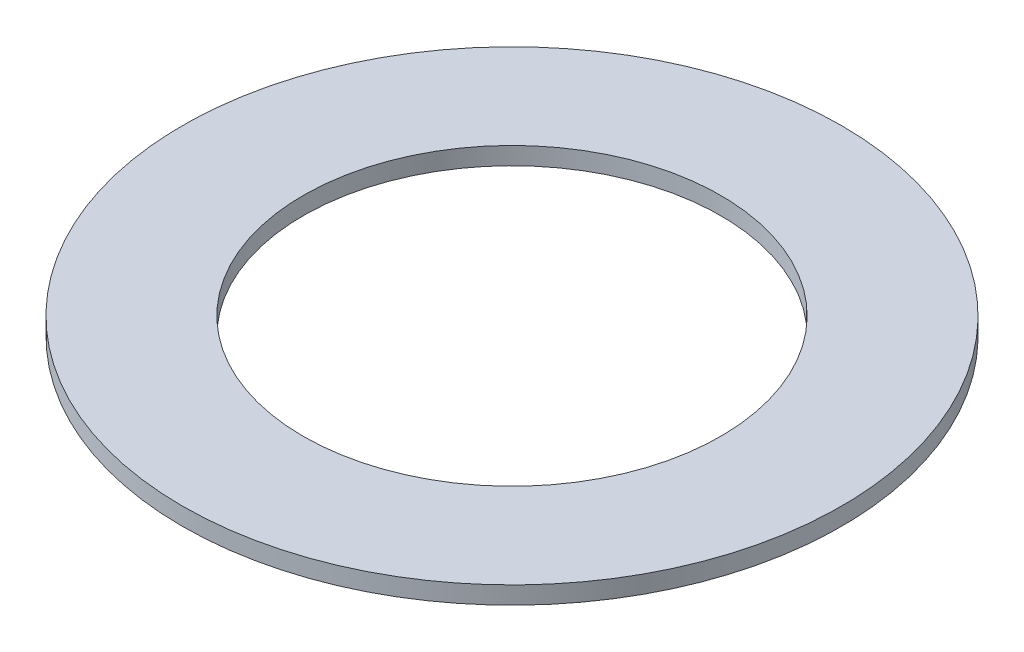
ISO-10303-21;
HEADER;
FILE_DESCRIPTION(('STEP AP214'),'2;1');
FILE_NAME('part.step','',(''),(''),'','','');
FILE_SCHEMA(('AUTOMOTIVE_DESIGN { 1 0 10303 214 1 1 1 1 }'));
ENDSEC;
DATA;
#1=APPLICATION_CONTEXT('core data for automotive mechanical design processes');
#2=APPLICATION_PROTOCOL_DEFINITION('international standard','automotive_design',2000,#1);
#3=PRODUCT_CONTEXT('',#1,'mechanical');
#4=PRODUCT('Part','Part','',(#3));
#5=PRODUCT_RELATED_PRODUCT_CATEGORY('part','',(#4));
#6=PRODUCT_DEFINITION_FORMATION('','',#4);
#7=PRODUCT_DEFINITION_CONTEXT('part definition',#1,'design');
#8=PRODUCT_DEFINITION('design','',#6,#7);
#9=PRODUCT_DEFINITION_SHAPE('','',#8);
#10=(LENGTH_UNIT() NAMED_UNIT(*) SI_UNIT(.MILLI.,.METRE.));
#11=(NAMED_UNIT(*) PLANE_ANGLE_UNIT() SI_UNIT($,.RADIAN.));
#12=(NAMED_UNIT(*) SI_UNIT($,.STERADIAN.) SOLID_ANGLE_UNIT());
#13=UNCERTAINTY_MEASURE_WITH_UNIT(LENGTH_MEASURE(1.E-05),#10,'distance_accuracy_value','');
#14=(GEOMETRIC_REPRESENTATION_CONTEXT(3) GLOBAL_UNCERTAINTY_ASSIGNED_CONTEXT((#13)) GLOBAL_UNIT_ASSIGNED_CONTEXT((#10,
#11,#12)) REPRESENTATION_CONTEXT('',''));
#15=CARTESIAN_POINT('',(0.,0.,0.));
#16=DIRECTION('',(0.,0.,1.));
#17=DIRECTION('',(1.,0.,0.));
#18=AXIS2_PLACEMENT_3D('',#15,#16,#17);
#19=CARTESIAN_POINT('',(0.,4.,0.));
#20=DIRECTION('',(0.,-1.,0.));
#21=DIRECTION('',(0.,0.,-1.));
#22=AXIS2_PLACEMENT_3D('',#19,#20,#21);
#23=CYLINDRICAL_SURFACE('',#22,75.);
#24=CARTESIAN_POINT('',(0.,4.,0.));
#25=DIRECTION('',(0.,1.,0.));
#26=DIRECTION('',(0.,0.,1.));
#27=AXIS2_PLACEMENT_3D('',#24,#25,#26);
#28=CIRCLE('',#27,75.);
#29=CARTESIAN_POINT('',(0.,4.,75.));
#30=VERTEX_POINT('',#29);
#31=EDGE_CURVE('E10',#30,#30,#28,.T.);
#32=ORIENTED_EDGE('',*,*,#31,.F.);
#33=EDGE_LOOP('',(#32));
#34=FACE_BOUND('',#33,.T.);
#35=CARTESIAN_POINT('',(0.,0.,0.));
#36=DIRECTION('',(0.,1.,0.));
#37=DIRECTION('',(0.,0.,1.));
#38=AXIS2_PLACEMENT_3D('',#35,#36,#37);
#39=CIRCLE('',#38,75.);
#40=CARTESIAN_POINT('',(0.,0.,75.));
#41=VERTEX_POINT('',#40);
#42=EDGE_CURVE('E37',#41,#41,#39,.T.);
#43=ORIENTED_EDGE('',*,*,#42,.T.);
#44=EDGE_LOOP('',(#43));
#45=FACE_BOUND('',#44,.T.);
#46=ADVANCED_FACE('F40',(#34,#45),#23,.T.);
#47=CARTESIAN_POINT('',(0.,4.,0.));
#48=DIRECTION('',(0.,1.,0.));
#49=DIRECTION('',(0.,0.,1.));
#50=AXIS2_PLACEMENT_3D('',#47,#48,#49);
#51=PLANE('',#50);
#52=CARTESIAN_POINT('',(0.,4.,0.));
#53=DIRECTION('',(0.,1.,0.));
#54=DIRECTION('',(0.,0.,1.));
#55=AXIS2_PLACEMENT_3D('',#52,#53,#54);
#56=CIRCLE('',#55,47.5);
#57=CARTESIAN_POINT('',(0.,4.,47.5));
#58=VERTEX_POINT('',#57);
#59=EDGE_CURVE('E50',#58,#58,#56,.T.);
#60=ORIENTED_EDGE('',*,*,#59,.F.);
#61=EDGE_LOOP('',(#60));
#62=FACE_BOUND('',#61,.T.);
#63=ORIENTED_EDGE('',*,*,#31,.T.);
#64=EDGE_LOOP('',(#63));
#65=FACE_BOUND('',#64,.T.);
#66=ADVANCED_FACE('F59',(#62,#65),#51,.T.);
#67=CARTESIAN_POINT('',(0.,0.,0.));
#68=DIRECTION('',(0.,1.,0.));
#69=DIRECTION('',(0.,0.,1.));
#70=AXIS2_PLACEMENT_3D('',#67,#68,#69);
#71=PLANE('',#70);
#72=CARTESIAN_POINT('',(0.,0.,0.));
#73=DIRECTION('',(0.,1.,0.));
#74=DIRECTION('',(0.,0.,1.));
#75=AXIS2_PLACEMENT_3D('',#72,#73,#74);
#76=CIRCLE('',#75,47.5);
#77=CARTESIAN_POINT('',(0.,0.,47.5));
#78=VERTEX_POINT('',#77);
#79=EDGE_CURVE('E47',#78,#78,#76,.T.);
#80=ORIENTED_EDGE('',*,*,#79,.T.);
#81=EDGE_LOOP('',(#80));
#82=FACE_BOUND('',#81,.T.);
#83=ORIENTED_EDGE('',*,*,#42,.F.);
#84=EDGE_LOOP('',(#83));
#85=FACE_BOUND('',#84,.T.);
#86=ADVANCED_FACE('F58',(#82,#85),#71,.F.);
#87=CARTESIAN_POINT('',(0.,4.,0.));
#88=DIRECTION('',(0.,-1.,0.));
#89=DIRECTION('',(0.,0.,-1.));
#90=AXIS2_PLACEMENT_3D('',#87,#88,#89);
#91=CYLINDRICAL_SURFACE('',#90,47.5);
#92=ORIENTED_EDGE('',*,*,#59,.T.);
#93=EDGE_LOOP('',(#92));
#94=FACE_BOUND('',#93,.T.);
#95=ORIENTED_EDGE('',*,*,#79,.F.);
#96=EDGE_LOOP('',(#95));
#97=FACE_BOUND('',#96,.T.);
#98=ADVANCED_FACE('F54',(#94,#97),#91,.F.);
#99=CLOSED_SHELL('',(#46,#66,#86,#98));
#100=MANIFOLD_SOLID_BREP('B2',#99);
#101=ADVANCED_BREP_SHAPE_REPRESENTATION('',(#18,#100),#14);
#102=SHAPE_DEFINITION_REPRESENTATION(#9,#101);
ENDSEC;
END-ISO-10303-21;
